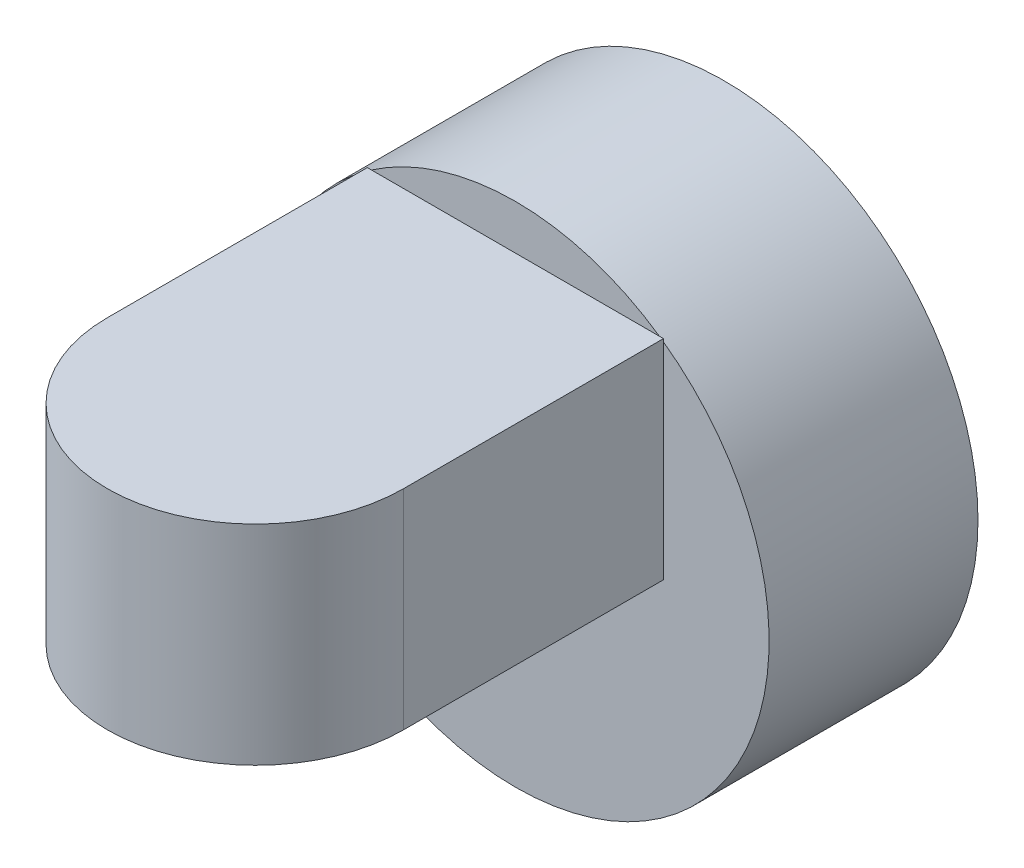
ISO-10303-21;
HEADER;
FILE_DESCRIPTION(('STEP AP214'),'2;1');
FILE_NAME('part.step','',(''),(''),'','','');
FILE_SCHEMA(('AUTOMOTIVE_DESIGN { 1 0 10303 214 1 1 1 1 }'));
ENDSEC;
DATA;
#1=APPLICATION_CONTEXT('core data for automotive mechanical design processes');
#2=APPLICATION_PROTOCOL_DEFINITION('international standard','automotive_design',2000,#1);
#3=PRODUCT_CONTEXT('',#1,'mechanical');
#4=PRODUCT('Part','Part','',(#3));
#5=PRODUCT_RELATED_PRODUCT_CATEGORY('part','',(#4));
#6=PRODUCT_DEFINITION_FORMATION('','',#4);
#7=PRODUCT_DEFINITION_CONTEXT('part definition',#1,'design');
#8=PRODUCT_DEFINITION('design','',#6,#7);
#9=PRODUCT_DEFINITION_SHAPE('','',#8);
#10=(LENGTH_UNIT() NAMED_UNIT(*) SI_UNIT(.MILLI.,.METRE.));
#11=(NAMED_UNIT(*) PLANE_ANGLE_UNIT() SI_UNIT($,.RADIAN.));
#12=(NAMED_UNIT(*) SI_UNIT($,.STERADIAN.) SOLID_ANGLE_UNIT());
#13=UNCERTAINTY_MEASURE_WITH_UNIT(LENGTH_MEASURE(1.E-05),#10,'distance_accuracy_value','');
#14=(GEOMETRIC_REPRESENTATION_CONTEXT(3) GLOBAL_UNCERTAINTY_ASSIGNED_CONTEXT((#13)) GLOBAL_UNIT_ASSIGNED_CONTEXT((#10,
#11,#12)) REPRESENTATION_CONTEXT('',''));
#15=CARTESIAN_POINT('',(0.,0.,0.));
#16=DIRECTION('',(0.,0.,1.));
#17=DIRECTION('',(1.,0.,0.));
#18=AXIS2_PLACEMENT_3D('',#15,#16,#17);
#19=CARTESIAN_POINT('',(0.,0.,10.58));
#20=DIRECTION('',(0.,0.,1.));
#21=DIRECTION('',(1.,0.,0.));
#22=AXIS2_PLACEMENT_3D('',#19,#20,#21);
#23=PLANE('',#22);
#24=CARTESIAN_POINT('',(0.,0.,10.58));
#25=DIRECTION('',(0.,0.,1.));
#26=DIRECTION('',(1.,0.,0.));
#27=AXIS2_PLACEMENT_3D('',#24,#25,#26);
#28=CIRCLE('',#27,12.85);
#29=CARTESIAN_POINT('',(7.29288008951196,10.58,10.58));
#30=VERTEX_POINT('',#29);
#31=CARTESIAN_POINT('',(-7.29288008951196,10.58,10.58));
#32=VERTEX_POINT('',#31);
#33=EDGE_CURVE('E132',#30,#32,#28,.T.);
#34=ORIENTED_EDGE('',*,*,#33,.T.);
#35=DIRECTION('',(1.,0.,0.));
#36=VECTOR('',#35,1.);
#37=CARTESIAN_POINT('',(0.,10.58,10.58));
#38=LINE('',#37,#36);
#39=EDGE_CURVE('E11',#32,#30,#38,.T.);
#40=ORIENTED_EDGE('',*,*,#39,.T.);
#41=EDGE_LOOP('',(#34,#40));
#42=FACE_BOUND('',#41,.T.);
#43=ADVANCED_FACE('F35',(#42),#23,.T.);
#44=CARTESIAN_POINT('',(0.,0.,10.58));
#45=DIRECTION('',(0.,0.,-1.));
#46=DIRECTION('',(-1.,0.,0.));
#47=AXIS2_PLACEMENT_3D('',#44,#45,#46);
#48=CYLINDRICAL_SURFACE('',#47,12.85);
#49=CARTESIAN_POINT('',(7.49999999999999,10.4341985796706,10.58));
#50=VERTEX_POINT('',#49);
#51=EDGE_CURVE('E131',#50,#30,#28,.T.);
#52=ORIENTED_EDGE('',*,*,#51,.F.);
#53=CARTESIAN_POINT('',(-7.5,10.4341985796706,10.58));
#54=VERTEX_POINT('',#53);
#55=EDGE_CURVE('E133',#54,#50,#28,.T.);
#56=ORIENTED_EDGE('',*,*,#55,.F.);
#57=EDGE_CURVE('E138',#32,#54,#28,.T.);
#58=ORIENTED_EDGE('',*,*,#57,.F.);
#59=ORIENTED_EDGE('',*,*,#33,.F.);
#60=EDGE_LOOP('',(#52,#56,#58,#59));
#61=FACE_BOUND('',#60,.T.);
#62=CARTESIAN_POINT('',(0.,0.,0.));
#63=DIRECTION('',(0.,0.,1.));
#64=DIRECTION('',(1.,0.,0.));
#65=AXIS2_PLACEMENT_3D('',#62,#63,#64);
#66=CIRCLE('',#65,12.85);
#67=CARTESIAN_POINT('',(12.85,0.,0.));
#68=VERTEX_POINT('',#67);
#69=EDGE_CURVE('E39',#68,#68,#66,.T.);
#70=ORIENTED_EDGE('',*,*,#69,.T.);
#71=EDGE_LOOP('',(#70));
#72=FACE_BOUND('',#71,.T.);
#73=ADVANCED_FACE('F37',(#61,#72),#48,.T.);
#74=DIRECTION('',(0.,-1.,0.));
#75=VECTOR('',#74,1.);
#76=CARTESIAN_POINT('',(-7.5,10.58,10.58));
#77=LINE('',#76,#75);
#78=CARTESIAN_POINT('',(-7.5,0.,10.58));
#79=VERTEX_POINT('',#78);
#80=EDGE_CURVE('E44',#54,#79,#77,.T.);
#81=ORIENTED_EDGE('',*,*,#80,.F.);
#82=ORIENTED_EDGE('',*,*,#55,.T.);
#83=DIRECTION('',(0.,-1.,0.));
#84=VECTOR('',#83,1.);
#85=CARTESIAN_POINT('',(7.49999999999999,10.58,10.58));
#86=LINE('',#85,#84);
#87=CARTESIAN_POINT('',(7.49999999999999,0.,10.58));
#88=VERTEX_POINT('',#87);
#89=EDGE_CURVE('E61',#50,#88,#86,.T.);
#90=ORIENTED_EDGE('',*,*,#89,.T.);
#91=DIRECTION('',(1.,0.,0.));
#92=VECTOR('',#91,1.);
#93=CARTESIAN_POINT('',(0.,0.,10.58));
#94=LINE('',#93,#92);
#95=EDGE_CURVE('E54',#79,#88,#94,.T.);
#96=ORIENTED_EDGE('',*,*,#95,.F.);
#97=EDGE_LOOP('',(#81,#82,#90,#96));
#98=FACE_BOUND('',#97,.T.);
#99=ADVANCED_FACE('F150',(#98),#23,.T.);
#100=CARTESIAN_POINT('',(0.,0.,0.));
#101=DIRECTION('',(0.,0.,1.));
#102=DIRECTION('',(1.,0.,0.));
#103=AXIS2_PLACEMENT_3D('',#100,#101,#102);
#104=PLANE('',#103);
#105=ORIENTED_EDGE('',*,*,#69,.F.);
#106=EDGE_LOOP('',(#105));
#107=FACE_BOUND('',#106,.T.);
#108=ADVANCED_FACE('F147',(#107),#104,.F.);
#109=CARTESIAN_POINT('',(0.,10.58,10.58));
#110=DIRECTION('',(0.,0.,-1.));
#111=DIRECTION('',(-1.,0.,0.));
#112=AXIS2_PLACEMENT_3D('',#109,#110,#111);
#113=PLANE('',#112);
#114=CARTESIAN_POINT('',(7.49999999999999,10.58,10.58));
#115=VERTEX_POINT('',#114);
#116=EDGE_CURVE('E129',#115,#50,#86,.T.);
#117=ORIENTED_EDGE('',*,*,#116,.T.);
#118=ORIENTED_EDGE('',*,*,#51,.T.);
#119=EDGE_CURVE('E47',#30,#115,#38,.T.);
#120=ORIENTED_EDGE('',*,*,#119,.T.);
#121=EDGE_LOOP('',(#117,#118,#120));
#122=FACE_BOUND('',#121,.T.);
#123=ADVANCED_FACE('F149',(#122),#113,.T.);
#124=CARTESIAN_POINT('',(-7.5,10.58,0.));
#125=DIRECTION('',(-1.,0.,0.));
#126=DIRECTION('',(0.,0.,1.));
#127=AXIS2_PLACEMENT_3D('',#124,#125,#126);
#128=PLANE('',#127);
#129=DIRECTION('',(0.,0.,-1.));
#130=VECTOR('',#129,1.);
#131=CARTESIAN_POINT('',(-7.5,0.,0.));
#132=LINE('',#131,#130);
#133=CARTESIAN_POINT('',(-7.5,0.,23.7492531033337));
#134=VERTEX_POINT('',#133);
#135=EDGE_CURVE('E102',#134,#79,#132,.T.);
#136=ORIENTED_EDGE('',*,*,#135,.F.);
#137=DIRECTION('',(0.,-1.,0.));
#138=VECTOR('',#137,1.);
#139=CARTESIAN_POINT('',(-7.5,10.58,23.7492531033337));
#140=LINE('',#139,#138);
#141=CARTESIAN_POINT('',(-7.5,10.58,23.7492531033337));
#142=VERTEX_POINT('',#141);
#143=EDGE_CURVE('E95',#142,#134,#140,.T.);
#144=ORIENTED_EDGE('',*,*,#143,.F.);
#145=DIRECTION('',(0.,0.,-1.));
#146=VECTOR('',#145,1.);
#147=CARTESIAN_POINT('',(-7.5,10.58,0.));
#148=LINE('',#147,#146);
#149=CARTESIAN_POINT('',(-7.5,10.58,10.58));
#150=VERTEX_POINT('',#149);
#151=EDGE_CURVE('E100',#142,#150,#148,.T.);
#152=ORIENTED_EDGE('',*,*,#151,.T.);
#153=EDGE_CURVE('E123',#150,#54,#77,.T.);
#154=ORIENTED_EDGE('',*,*,#153,.T.);
#155=ORIENTED_EDGE('',*,*,#80,.T.);
#156=EDGE_LOOP('',(#136,#144,#152,#154,#155));
#157=FACE_BOUND('',#156,.T.);
#158=ADVANCED_FACE('F97',(#157),#128,.T.);
#159=CARTESIAN_POINT('',(0.,10.58,23.7492531033337));
#160=DIRECTION('',(0.,-1.,0.));
#161=DIRECTION('',(0.,0.,-1.));
#162=AXIS2_PLACEMENT_3D('',#159,#160,#161);
#163=CYLINDRICAL_SURFACE('',#162,7.5);
#164=CARTESIAN_POINT('',(0.,0.,23.7492531033337));
#165=DIRECTION('',(0.,1.,0.));
#166=DIRECTION('',(0.,0.,1.));
#167=AXIS2_PLACEMENT_3D('',#164,#165,#166);
#168=CIRCLE('',#167,7.5);
#169=CARTESIAN_POINT('',(7.5,0.,23.7492531033337));
#170=VERTEX_POINT('',#169);
#171=EDGE_CURVE('E125',#134,#170,#168,.T.);
#172=ORIENTED_EDGE('',*,*,#171,.T.);
#173=DIRECTION('',(0.,-1.,0.));
#174=VECTOR('',#173,1.);
#175=CARTESIAN_POINT('',(7.5,10.58,23.7492531033337));
#176=LINE('',#175,#174);
#177=CARTESIAN_POINT('',(7.5,10.58,23.7492531033337));
#178=VERTEX_POINT('',#177);
#179=EDGE_CURVE('E105',#178,#170,#176,.T.);
#180=ORIENTED_EDGE('',*,*,#179,.F.);
#181=CARTESIAN_POINT('',(0.,10.58,23.7492531033337));
#182=DIRECTION('',(0.,1.,0.));
#183=DIRECTION('',(0.,0.,1.));
#184=AXIS2_PLACEMENT_3D('',#181,#182,#183);
#185=CIRCLE('',#184,7.5);
#186=EDGE_CURVE('E108',#142,#178,#185,.T.);
#187=ORIENTED_EDGE('',*,*,#186,.F.);
#188=ORIENTED_EDGE('',*,*,#143,.T.);
#189=EDGE_LOOP('',(#172,#180,#187,#188));
#190=FACE_BOUND('',#189,.T.);
#191=ADVANCED_FACE('F109',(#190),#163,.T.);
#192=CARTESIAN_POINT('',(7.49999999999999,10.58,0.));
#193=DIRECTION('',(-1.,0.,0.));
#194=DIRECTION('',(0.,0.,1.));
#195=AXIS2_PLACEMENT_3D('',#192,#193,#194);
#196=PLANE('',#195);
#197=DIRECTION('',(0.,0.,-1.));
#198=VECTOR('',#197,1.);
#199=CARTESIAN_POINT('',(7.49999999999999,0.,0.));
#200=LINE('',#199,#198);
#201=EDGE_CURVE('E119',#170,#88,#200,.T.);
#202=ORIENTED_EDGE('',*,*,#201,.T.);
#203=ORIENTED_EDGE('',*,*,#89,.F.);
#204=ORIENTED_EDGE('',*,*,#116,.F.);
#205=DIRECTION('',(0.,0.,-1.));
#206=VECTOR('',#205,1.);
#207=CARTESIAN_POINT('',(7.49999999999999,10.58,0.));
#208=LINE('',#207,#206);
#209=EDGE_CURVE('E114',#178,#115,#208,.T.);
#210=ORIENTED_EDGE('',*,*,#209,.F.);
#211=ORIENTED_EDGE('',*,*,#179,.T.);
#212=EDGE_LOOP('',(#202,#203,#204,#210,#211));
#213=FACE_BOUND('',#212,.T.);
#214=ADVANCED_FACE('F169',(#213),#196,.F.);
#215=EDGE_CURVE('E46',#150,#32,#38,.T.);
#216=ORIENTED_EDGE('',*,*,#215,.T.);
#217=ORIENTED_EDGE('',*,*,#57,.T.);
#218=ORIENTED_EDGE('',*,*,#153,.F.);
#219=EDGE_LOOP('',(#216,#217,#218));
#220=FACE_BOUND('',#219,.T.);
#221=ADVANCED_FACE('F156',(#220),#113,.T.);
#222=CARTESIAN_POINT('',(0.,10.58,0.));
#223=DIRECTION('',(0.,1.,0.));
#224=DIRECTION('',(0.,0.,1.));
#225=AXIS2_PLACEMENT_3D('',#222,#223,#224);
#226=PLANE('',#225);
#227=ORIENTED_EDGE('',*,*,#151,.F.);
#228=ORIENTED_EDGE('',*,*,#186,.T.);
#229=ORIENTED_EDGE('',*,*,#209,.T.);
#230=ORIENTED_EDGE('',*,*,#119,.F.);
#231=ORIENTED_EDGE('',*,*,#39,.F.);
#232=ORIENTED_EDGE('',*,*,#215,.F.);
#233=EDGE_LOOP('',(#227,#228,#229,#230,#231,#232));
#234=FACE_BOUND('',#233,.T.);
#235=ADVANCED_FACE('F116',(#234),#226,.T.);
#236=CARTESIAN_POINT('',(0.,0.,0.));
#237=DIRECTION('',(0.,1.,0.));
#238=DIRECTION('',(0.,0.,1.));
#239=AXIS2_PLACEMENT_3D('',#236,#237,#238);
#240=PLANE('',#239);
#241=ORIENTED_EDGE('',*,*,#135,.T.);
#242=ORIENTED_EDGE('',*,*,#95,.T.);
#243=ORIENTED_EDGE('',*,*,#201,.F.);
#244=ORIENTED_EDGE('',*,*,#171,.F.);
#245=EDGE_LOOP('',(#241,#242,#243,#244));
#246=FACE_BOUND('',#245,.T.);
#247=ADVANCED_FACE('F174',(#246),#240,.F.);
#248=CLOSED_SHELL('',(#43,#73,#99,#108,#123,#158,#191,#214,#221,#235,#247));
#249=MANIFOLD_SOLID_BREP('B2',#248);
#250=ADVANCED_BREP_SHAPE_REPRESENTATION('',(#18,#249),#14);
#251=SHAPE_DEFINITION_REPRESENTATION(#9,#250);
ENDSEC;
END-ISO-10303-21;
